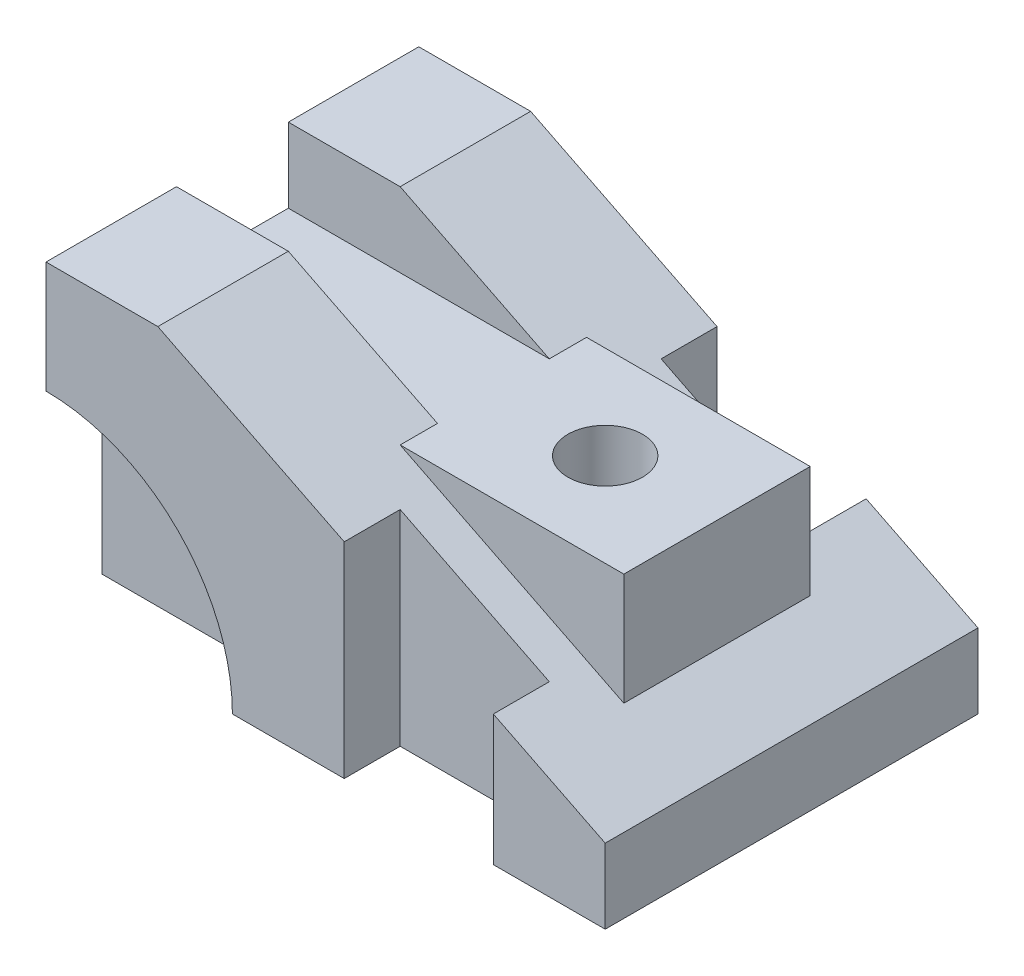
ISO-10303-21;
HEADER;
FILE_DESCRIPTION(('STEP AP214'),'2;1');
FILE_NAME('part.step','',(''),(''),'','','');
FILE_SCHEMA(('AUTOMOTIVE_DESIGN { 1 0 10303 214 1 1 1 1 }'));
ENDSEC;
DATA;
#1=APPLICATION_CONTEXT('core data for automotive mechanical design processes');
#2=APPLICATION_PROTOCOL_DEFINITION('international standard','automotive_design',2000,#1);
#3=PRODUCT_CONTEXT('',#1,'mechanical');
#4=PRODUCT('Part','Part','',(#3));
#5=PRODUCT_RELATED_PRODUCT_CATEGORY('part','',(#4));
#6=PRODUCT_DEFINITION_FORMATION('','',#4);
#7=PRODUCT_DEFINITION_CONTEXT('part definition',#1,'design');
#8=PRODUCT_DEFINITION('design','',#6,#7);
#9=PRODUCT_DEFINITION_SHAPE('','',#8);
#10=(LENGTH_UNIT() NAMED_UNIT(*) SI_UNIT(.MILLI.,.METRE.));
#11=(NAMED_UNIT(*) PLANE_ANGLE_UNIT() SI_UNIT($,.RADIAN.));
#12=(NAMED_UNIT(*) SI_UNIT($,.STERADIAN.) SOLID_ANGLE_UNIT());
#13=UNCERTAINTY_MEASURE_WITH_UNIT(LENGTH_MEASURE(1.E-05),#10,'distance_accuracy_value','');
#14=(GEOMETRIC_REPRESENTATION_CONTEXT(3) GLOBAL_UNCERTAINTY_ASSIGNED_CONTEXT((#13)) GLOBAL_UNIT_ASSIGNED_CONTEXT((#10,
#11,#12)) REPRESENTATION_CONTEXT('',''));
#15=CARTESIAN_POINT('',(0.,0.,0.));
#16=DIRECTION('',(0.,0.,1.));
#17=DIRECTION('',(1.,0.,0.));
#18=AXIS2_PLACEMENT_3D('',#15,#16,#17);
#19=CARTESIAN_POINT('',(-22.0618556701031,38.6082474226804,-100.));
#20=DIRECTION('',(0.,1.,0.));
#21=DIRECTION('',(-1.,0.,0.));
#22=AXIS2_PLACEMENT_3D('',#19,#20,#21);
#23=PLANE('',#22);
#24=DIRECTION('',(-1.,0.,0.));
#25=VECTOR('',#24,1.);
#26=CARTESIAN_POINT('',(47.9381443298969,38.6082474226804,-65.));
#27=LINE('',#26,#25);
#28=CARTESIAN_POINT('',(-22.0618556701031,38.6082474226804,-65.));
#29=VERTEX_POINT('',#28);
#30=CARTESIAN_POINT('',(-52.0618556701031,38.6082474226804,-65.));
#31=VERTEX_POINT('',#30);
#32=EDGE_CURVE('E238',#29,#31,#27,.T.);
#33=ORIENTED_EDGE('',*,*,#32,.F.);
#34=DIRECTION('',(0.,0.,1.));
#35=VECTOR('',#34,1.);
#36=CARTESIAN_POINT('',(-22.0618556701031,38.6082474226804,-100.));
#37=LINE('',#36,#35);
#38=CARTESIAN_POINT('',(-22.0618556701031,38.6082474226804,-100.));
#39=VERTEX_POINT('',#38);
#40=EDGE_CURVE('E411',#39,#29,#37,.T.);
#41=ORIENTED_EDGE('',*,*,#40,.F.);
#42=DIRECTION('',(-1.,0.,0.));
#43=VECTOR('',#42,1.);
#44=CARTESIAN_POINT('',(-22.0618556701031,38.6082474226804,-100.));
#45=LINE('',#44,#43);
#46=CARTESIAN_POINT('',(-52.0618556701031,38.6082474226804,-100.));
#47=VERTEX_POINT('',#46);
#48=EDGE_CURVE('E368',#39,#47,#45,.T.);
#49=ORIENTED_EDGE('',*,*,#48,.T.);
#50=DIRECTION('',(0.,0.,1.));
#51=VECTOR('',#50,1.);
#52=CARTESIAN_POINT('',(-52.0618556701031,38.6082474226804,-100.));
#53=LINE('',#52,#51);
#54=EDGE_CURVE('E427',#47,#31,#53,.T.);
#55=ORIENTED_EDGE('',*,*,#54,.T.);
#56=EDGE_LOOP('',(#33,#41,#49,#55));
#57=FACE_BOUND('',#56,.T.);
#58=ADVANCED_FACE('F45',(#57),#23,.T.);
#59=CARTESIAN_POINT('',(0.,0.,-100.));
#60=DIRECTION('',(0.,0.,1.));
#61=DIRECTION('',(1.,0.,0.));
#62=AXIS2_PLACEMENT_3D('',#59,#60,#61);
#63=PLANE('',#62);
#64=DIRECTION('',(-0.894427190999916,0.447213595499958,0.));
#65=VECTOR('',#64,1.);
#66=CARTESIAN_POINT('',(97.9381443298969,-21.3917525773196,-100.));
#67=LINE('',#66,#65);
#68=CARTESIAN_POINT('',(27.9381443298969,13.6082474226804,-100.));
#69=VERTEX_POINT('',#68);
#70=EDGE_CURVE('E386',#69,#39,#67,.T.);
#71=ORIENTED_EDGE('',*,*,#70,.F.);
#72=DIRECTION('',(0.,-1.,0.));
#73=VECTOR('',#72,1.);
#74=CARTESIAN_POINT('',(27.9381443298969,0.,-100.));
#75=LINE('',#74,#73);
#76=CARTESIAN_POINT('',(27.9381443298969,-41.3917525773196,-100.));
#77=VERTEX_POINT('',#76);
#78=EDGE_CURVE('E11',#69,#77,#75,.T.);
#79=ORIENTED_EDGE('',*,*,#78,.T.);
#80=DIRECTION('',(1.,0.,0.));
#81=VECTOR('',#80,1.);
#82=CARTESIAN_POINT('',(-52.0618556701031,-41.3917525773196,-100.));
#83=LINE('',#82,#81);
#84=CARTESIAN_POINT('',(-2.06185567010309,-41.3917525773196,-100.));
#85=VERTEX_POINT('',#84);
#86=EDGE_CURVE('E378',#85,#77,#83,.T.);
#87=ORIENTED_EDGE('',*,*,#86,.F.);
#88=CARTESIAN_POINT('',(-52.0618556701031,-41.3917525773196,-100.));
#89=DIRECTION('',(0.,0.,-1.));
#90=DIRECTION('',(-1.,0.,0.));
#91=AXIS2_PLACEMENT_3D('',#88,#89,#90);
#92=CIRCLE('',#91,50.);
#93=CARTESIAN_POINT('',(-52.0618556701031,8.6082474226804,-100.));
#94=VERTEX_POINT('',#93);
#95=EDGE_CURVE('E333',#94,#85,#92,.T.);
#96=ORIENTED_EDGE('',*,*,#95,.F.);
#97=DIRECTION('',(0.,-1.,0.));
#98=VECTOR('',#97,1.);
#99=CARTESIAN_POINT('',(-52.0618556701031,38.6082474226804,-100.));
#100=LINE('',#99,#98);
#101=EDGE_CURVE('E372',#47,#94,#100,.T.);
#102=ORIENTED_EDGE('',*,*,#101,.F.);
#103=ORIENTED_EDGE('',*,*,#48,.F.);
#104=EDGE_LOOP('',(#71,#79,#87,#96,#102,#103));
#105=FACE_BOUND('',#104,.T.);
#106=ADVANCED_FACE('F513',(#105),#63,.F.);
#107=CARTESIAN_POINT('',(0.,0.,0.));
#108=DIRECTION('',(0.,0.,1.));
#109=DIRECTION('',(1.,0.,0.));
#110=AXIS2_PLACEMENT_3D('',#107,#108,#109);
#111=PLANE('',#110);
#112=DIRECTION('',(0.,1.,0.));
#113=VECTOR('',#112,1.);
#114=CARTESIAN_POINT('',(67.9381443298969,0.,0.));
#115=LINE('',#114,#113);
#116=CARTESIAN_POINT('',(67.9381443298969,-41.3917525773196,0.));
#117=VERTEX_POINT('',#116);
#118=CARTESIAN_POINT('',(67.9381443298969,-6.39175257731959,0.));
#119=VERTEX_POINT('',#118);
#120=EDGE_CURVE('E441',#117,#119,#115,.T.);
#121=ORIENTED_EDGE('',*,*,#120,.F.);
#122=DIRECTION('',(1.,0.,0.));
#123=VECTOR('',#122,1.);
#124=CARTESIAN_POINT('',(-52.0618556701031,-41.3917525773196,0.));
#125=LINE('',#124,#123);
#126=CARTESIAN_POINT('',(97.9381443298969,-41.3917525773196,0.));
#127=VERTEX_POINT('',#126);
#128=EDGE_CURVE('E398',#117,#127,#125,.T.);
#129=ORIENTED_EDGE('',*,*,#128,.T.);
#130=DIRECTION('',(0.,1.,0.));
#131=VECTOR('',#130,1.);
#132=CARTESIAN_POINT('',(97.9381443298969,-41.3917525773196,0.));
#133=LINE('',#132,#131);
#134=CARTESIAN_POINT('',(97.9381443298969,-21.3917525773196,0.));
#135=VERTEX_POINT('',#134);
#136=EDGE_CURVE('E403',#127,#135,#133,.T.);
#137=ORIENTED_EDGE('',*,*,#136,.T.);
#138=DIRECTION('',(-0.894427190999916,0.447213595499958,0.));
#139=VECTOR('',#138,1.);
#140=CARTESIAN_POINT('',(97.9381443298969,-21.3917525773196,0.));
#141=LINE('',#140,#139);
#142=EDGE_CURVE('E373',#135,#119,#141,.T.);
#143=ORIENTED_EDGE('',*,*,#142,.T.);
#144=EDGE_LOOP('',(#121,#129,#137,#143));
#145=FACE_BOUND('',#144,.T.);
#146=ADVANCED_FACE('F473',(#145),#111,.T.);
#147=DIRECTION('',(-1.,0.,0.));
#148=VECTOR('',#147,1.);
#149=CARTESIAN_POINT('',(47.9381443298969,38.6082474226804,-35.));
#150=LINE('',#149,#148);
#151=CARTESIAN_POINT('',(-22.0618556701031,38.6082474226804,-35.));
#152=VERTEX_POINT('',#151);
#153=CARTESIAN_POINT('',(-52.0618556701031,38.6082474226804,-35.));
#154=VERTEX_POINT('',#153);
#155=EDGE_CURVE('E219',#152,#154,#150,.T.);
#156=ORIENTED_EDGE('',*,*,#155,.T.);
#157=CARTESIAN_POINT('',(-52.0618556701031,38.6082474226804,0.));
#158=VERTEX_POINT('',#157);
#159=EDGE_CURVE('E231',#154,#158,#53,.T.);
#160=ORIENTED_EDGE('',*,*,#159,.T.);
#161=DIRECTION('',(-1.,0.,0.));
#162=VECTOR('',#161,1.);
#163=CARTESIAN_POINT('',(-22.0618556701031,38.6082474226804,0.));
#164=LINE('',#163,#162);
#165=CARTESIAN_POINT('',(-22.0618556701031,38.6082474226804,0.));
#166=VERTEX_POINT('',#165);
#167=EDGE_CURVE('E367',#166,#158,#164,.T.);
#168=ORIENTED_EDGE('',*,*,#167,.F.);
#169=EDGE_CURVE('E416',#152,#166,#37,.T.);
#170=ORIENTED_EDGE('',*,*,#169,.F.);
#171=EDGE_LOOP('',(#156,#160,#168,#170));
#172=FACE_BOUND('',#171,.T.);
#173=ADVANCED_FACE('F47',(#172),#23,.T.);
#174=CARTESIAN_POINT('',(97.9381443298969,-21.3917525773196,-100.));
#175=DIRECTION('',(0.447213595499958,0.894427190999916,0.));
#176=DIRECTION('',(-0.894427190999916,0.447213595499958,0.));
#177=AXIS2_PLACEMENT_3D('',#174,#175,#176);
#178=PLANE('',#177);
#179=DIRECTION('',(-0.894427190999916,0.447213595499958,0.));
#180=VECTOR('',#179,1.);
#181=CARTESIAN_POINT('',(97.9381443298969,-21.3917525773196,-65.));
#182=LINE('',#181,#180);
#183=CARTESIAN_POINT('',(17.9381443298969,18.6082474226804,-65.));
#184=VERTEX_POINT('',#183);
#185=EDGE_CURVE('E245',#184,#29,#182,.T.);
#186=ORIENTED_EDGE('',*,*,#185,.F.);
#187=DIRECTION('',(0.,0.,-1.));
#188=VECTOR('',#187,1.);
#189=CARTESIAN_POINT('',(17.9381443298969,18.6082474226804,-25.));
#190=LINE('',#189,#188);
#191=CARTESIAN_POINT('',(17.9381443298969,18.6082474226804,-75.));
#192=VERTEX_POINT('',#191);
#193=EDGE_CURVE('E69',#184,#192,#190,.T.);
#194=ORIENTED_EDGE('',*,*,#193,.T.);
#195=DIRECTION('',(-0.894427190999916,0.447213595499958,0.));
#196=VECTOR('',#195,1.);
#197=CARTESIAN_POINT('',(97.9381443298969,-21.3917525773196,-75.));
#198=LINE('',#197,#196);
#199=CARTESIAN_POINT('',(77.9381443298969,-11.3917525773196,-75.));
#200=VERTEX_POINT('',#199);
#201=EDGE_CURVE('E268',#200,#192,#198,.T.);
#202=ORIENTED_EDGE('',*,*,#201,.F.);
#203=DIRECTION('',(0.,0.,-1.));
#204=VECTOR('',#203,1.);
#205=CARTESIAN_POINT('',(77.9381443298969,-11.3917525773196,-100.));
#206=LINE('',#205,#204);
#207=CARTESIAN_POINT('',(77.9381443298969,-11.3917525773196,-25.));
#208=VERTEX_POINT('',#207);
#209=EDGE_CURVE('E275',#208,#200,#206,.T.);
#210=ORIENTED_EDGE('',*,*,#209,.F.);
#211=DIRECTION('',(0.894427190999916,-0.447213595499958,0.));
#212=VECTOR('',#211,1.);
#213=CARTESIAN_POINT('',(97.9381443298969,-21.3917525773196,-25.));
#214=LINE('',#213,#212);
#215=CARTESIAN_POINT('',(17.9381443298969,18.6082474226804,-25.));
#216=VERTEX_POINT('',#215);
#217=EDGE_CURVE('E278',#216,#208,#214,.T.);
#218=ORIENTED_EDGE('',*,*,#217,.F.);
#219=CARTESIAN_POINT('',(17.9381443298969,18.6082474226804,-35.));
#220=VERTEX_POINT('',#219);
#221=EDGE_CURVE('E248',#216,#220,#190,.T.);
#222=ORIENTED_EDGE('',*,*,#221,.T.);
#223=DIRECTION('',(0.894427190999916,-0.447213595499958,0.));
#224=VECTOR('',#223,1.);
#225=CARTESIAN_POINT('',(97.9381443298969,-21.3917525773196,-35.));
#226=LINE('',#225,#224);
#227=EDGE_CURVE('E215',#152,#220,#226,.T.);
#228=ORIENTED_EDGE('',*,*,#227,.F.);
#229=ORIENTED_EDGE('',*,*,#169,.T.);
#230=CARTESIAN_POINT('',(27.9381443298969,13.6082474226804,0.));
#231=VERTEX_POINT('',#230);
#232=EDGE_CURVE('E407',#231,#166,#141,.T.);
#233=ORIENTED_EDGE('',*,*,#232,.F.);
#234=DIRECTION('',(0.,0.,1.));
#235=VECTOR('',#234,1.);
#236=CARTESIAN_POINT('',(27.9381443298969,13.6082474226804,-100.));
#237=LINE('',#236,#235);
#238=CARTESIAN_POINT('',(27.9381443298969,13.6082474226804,-15.));
#239=VERTEX_POINT('',#238);
#240=EDGE_CURVE('E298',#239,#231,#237,.T.);
#241=ORIENTED_EDGE('',*,*,#240,.F.);
#242=DIRECTION('',(-0.894427190999916,0.447213595499958,0.));
#243=VECTOR('',#242,1.);
#244=CARTESIAN_POINT('',(97.9381443298969,-21.3917525773196,-15.));
#245=LINE('',#244,#243);
#246=CARTESIAN_POINT('',(67.9381443298969,-6.3917525773196,-15.));
#247=VERTEX_POINT('',#246);
#248=EDGE_CURVE('E330',#247,#239,#245,.T.);
#249=ORIENTED_EDGE('',*,*,#248,.F.);
#250=DIRECTION('',(0.,0.,-1.));
#251=VECTOR('',#250,1.);
#252=CARTESIAN_POINT('',(67.9381443298969,-6.39175257731959,-100.));
#253=LINE('',#252,#251);
#254=EDGE_CURVE('E318',#119,#247,#253,.T.);
#255=ORIENTED_EDGE('',*,*,#254,.F.);
#256=ORIENTED_EDGE('',*,*,#142,.F.);
#257=DIRECTION('',(0.,0.,1.));
#258=VECTOR('',#257,1.);
#259=CARTESIAN_POINT('',(97.9381443298969,-21.3917525773196,-100.));
#260=LINE('',#259,#258);
#261=CARTESIAN_POINT('',(97.9381443298969,-21.3917525773196,-100.));
#262=VERTEX_POINT('',#261);
#263=EDGE_CURVE('E417',#262,#135,#260,.T.);
#264=ORIENTED_EDGE('',*,*,#263,.F.);
#265=CARTESIAN_POINT('',(67.9381443298969,-6.39175257731959,-100.));
#266=VERTEX_POINT('',#265);
#267=EDGE_CURVE('E387',#262,#266,#67,.T.);
#268=ORIENTED_EDGE('',*,*,#267,.T.);
#269=DIRECTION('',(0.,0.,-1.));
#270=VECTOR('',#269,1.);
#271=CARTESIAN_POINT('',(67.9381443298969,-6.39175257731959,-100.));
#272=LINE('',#271,#270);
#273=CARTESIAN_POINT('',(67.9381443298969,-6.3917525773196,-85.));
#274=VERTEX_POINT('',#273);
#275=EDGE_CURVE('E321',#274,#266,#272,.T.);
#276=ORIENTED_EDGE('',*,*,#275,.F.);
#277=DIRECTION('',(0.894427190999916,-0.447213595499958,0.));
#278=VECTOR('',#277,1.);
#279=CARTESIAN_POINT('',(97.9381443298969,-21.3917525773196,-85.));
#280=LINE('',#279,#278);
#281=CARTESIAN_POINT('',(27.9381443298969,13.6082474226804,-85.));
#282=VERTEX_POINT('',#281);
#283=EDGE_CURVE('E327',#282,#274,#280,.T.);
#284=ORIENTED_EDGE('',*,*,#283,.F.);
#285=DIRECTION('',(0.,0.,1.));
#286=VECTOR('',#285,1.);
#287=CARTESIAN_POINT('',(27.9381443298969,13.6082474226804,-100.));
#288=LINE('',#287,#286);
#289=EDGE_CURVE('E324',#69,#282,#288,.T.);
#290=ORIENTED_EDGE('',*,*,#289,.F.);
#291=ORIENTED_EDGE('',*,*,#70,.T.);
#292=ORIENTED_EDGE('',*,*,#40,.T.);
#293=EDGE_LOOP('',(#186,#194,#202,#210,#218,#222,#228,#229,#233,#241,#249,#255,#256,#264,#268,
#276,#284,#290,#291,#292));
#294=FACE_BOUND('',#293,.T.);
#295=ADVANCED_FACE('F453',(#294),#178,.T.);
#296=CARTESIAN_POINT('',(97.9381443298969,-41.3917525773196,-100.));
#297=DIRECTION('',(1.,0.,0.));
#298=DIRECTION('',(0.,0.,-1.));
#299=AXIS2_PLACEMENT_3D('',#296,#297,#298);
#300=PLANE('',#299);
#301=ORIENTED_EDGE('',*,*,#136,.F.);
#302=DIRECTION('',(0.,0.,1.));
#303=VECTOR('',#302,1.);
#304=CARTESIAN_POINT('',(97.9381443298969,-41.3917525773196,-100.));
#305=LINE('',#304,#303);
#306=CARTESIAN_POINT('',(97.9381443298969,-41.3917525773196,-100.));
#307=VERTEX_POINT('',#306);
#308=EDGE_CURVE('E420',#307,#127,#305,.T.);
#309=ORIENTED_EDGE('',*,*,#308,.F.);
#310=DIRECTION('',(0.,1.,0.));
#311=VECTOR('',#310,1.);
#312=CARTESIAN_POINT('',(97.9381443298969,-41.3917525773196,-100.));
#313=LINE('',#312,#311);
#314=EDGE_CURVE('E382',#307,#262,#313,.T.);
#315=ORIENTED_EDGE('',*,*,#314,.T.);
#316=ORIENTED_EDGE('',*,*,#263,.T.);
#317=EDGE_LOOP('',(#301,#309,#315,#316));
#318=FACE_BOUND('',#317,.T.);
#319=ADVANCED_FACE('F460',(#318),#300,.T.);
#320=CARTESIAN_POINT('',(-52.0618556701031,-41.3917525773196,-100.));
#321=DIRECTION('',(0.,-1.,0.));
#322=DIRECTION('',(0.,0.,-1.));
#323=AXIS2_PLACEMENT_3D('',#320,#321,#322);
#324=PLANE('',#323);
#325=CARTESIAN_POINT('',(47.9381443298969,-41.3917525773196,-50.));
#326=DIRECTION('',(0.,-1.,0.));
#327=DIRECTION('',(0.,0.,-1.));
#328=AXIS2_PLACEMENT_3D('',#325,#326,#327);
#329=CIRCLE('',#328,10.);
#330=CARTESIAN_POINT('',(47.9381443298969,-41.3917525773196,-60.));
#331=VERTEX_POINT('',#330);
#332=EDGE_CURVE('E760',#331,#331,#329,.T.);
#333=ORIENTED_EDGE('',*,*,#332,.F.);
#334=EDGE_LOOP('',(#333));
#335=FACE_BOUND('',#334,.T.);
#336=DIRECTION('',(0.,0.,1.));
#337=VECTOR('',#336,1.);
#338=CARTESIAN_POINT('',(67.9381443298969,-41.3917525773196,0.));
#339=LINE('',#338,#337);
#340=CARTESIAN_POINT('',(67.9381443298969,-41.3917525773196,-15.));
#341=VERTEX_POINT('',#340);
#342=EDGE_CURVE('E282',#341,#117,#339,.T.);
#343=ORIENTED_EDGE('',*,*,#342,.F.);
#344=DIRECTION('',(1.,0.,0.));
#345=VECTOR('',#344,1.);
#346=CARTESIAN_POINT('',(67.9381443298969,-41.3917525773196,-15.));
#347=LINE('',#346,#345);
#348=CARTESIAN_POINT('',(27.9381443298969,-41.3917525773196,-15.));
#349=VERTEX_POINT('',#348);
#350=EDGE_CURVE('E290',#349,#341,#347,.T.);
#351=ORIENTED_EDGE('',*,*,#350,.F.);
#352=DIRECTION('',(0.,0.,-1.));
#353=VECTOR('',#352,1.);
#354=CARTESIAN_POINT('',(27.9381443298969,-41.3917525773196,0.));
#355=LINE('',#354,#353);
#356=CARTESIAN_POINT('',(27.9381443298969,-41.3917525773196,0.));
#357=VERTEX_POINT('',#356);
#358=EDGE_CURVE('E285',#357,#349,#355,.T.);
#359=ORIENTED_EDGE('',*,*,#358,.F.);
#360=CARTESIAN_POINT('',(-2.06185567010309,-41.3917525773196,0.));
#361=VERTEX_POINT('',#360);
#362=EDGE_CURVE('E399',#361,#357,#125,.T.);
#363=ORIENTED_EDGE('',*,*,#362,.F.);
#364=DIRECTION('',(0.,0.,1.));
#365=VECTOR('',#364,1.);
#366=CARTESIAN_POINT('',(-2.06185567010309,-41.3917525773196,-15.));
#367=LINE('',#366,#365);
#368=CARTESIAN_POINT('',(-2.06185567010309,-41.3917525773196,-15.));
#369=VERTEX_POINT('',#368);
#370=EDGE_CURVE('E360',#369,#361,#367,.T.);
#371=ORIENTED_EDGE('',*,*,#370,.F.);
#372=DIRECTION('',(-1.,0.,0.));
#373=VECTOR('',#372,1.);
#374=CARTESIAN_POINT('',(-52.0618556701031,-41.3917525773196,-15.));
#375=LINE('',#374,#373);
#376=CARTESIAN_POINT('',(-52.0618556701031,-41.3917525773196,-15.));
#377=VERTEX_POINT('',#376);
#378=EDGE_CURVE('E363',#369,#377,#375,.T.);
#379=ORIENTED_EDGE('',*,*,#378,.T.);
#380=DIRECTION('',(0.,0.,1.));
#381=VECTOR('',#380,1.);
#382=CARTESIAN_POINT('',(-52.0618556701031,-41.3917525773196,-100.));
#383=LINE('',#382,#381);
#384=CARTESIAN_POINT('',(-52.0618556701031,-41.3917525773196,-85.));
#385=VERTEX_POINT('',#384);
#386=EDGE_CURVE('E424',#385,#377,#383,.T.);
#387=ORIENTED_EDGE('',*,*,#386,.F.);
#388=DIRECTION('',(1.,0.,0.));
#389=VECTOR('',#388,1.);
#390=CARTESIAN_POINT('',(-52.0618556701031,-41.3917525773196,-85.));
#391=LINE('',#390,#389);
#392=CARTESIAN_POINT('',(-2.06185567010309,-41.3917525773196,-85.));
#393=VERTEX_POINT('',#392);
#394=EDGE_CURVE('E346',#385,#393,#391,.T.);
#395=ORIENTED_EDGE('',*,*,#394,.T.);
#396=DIRECTION('',(0.,0.,-1.));
#397=VECTOR('',#396,1.);
#398=CARTESIAN_POINT('',(-2.06185567010309,-41.3917525773196,-85.));
#399=LINE('',#398,#397);
#400=EDGE_CURVE('E343',#85,#393,#399,.F.);
#401=ORIENTED_EDGE('',*,*,#400,.F.);
#402=ORIENTED_EDGE('',*,*,#86,.T.);
#403=DIRECTION('',(0.,0.,-1.));
#404=VECTOR('',#403,1.);
#405=CARTESIAN_POINT('',(27.9381443298969,-41.3917525773196,-100.));
#406=LINE('',#405,#404);
#407=CARTESIAN_POINT('',(27.9381443298969,-41.3917525773196,-85.));
#408=VERTEX_POINT('',#407);
#409=EDGE_CURVE('E286',#408,#77,#406,.T.);
#410=ORIENTED_EDGE('',*,*,#409,.F.);
#411=DIRECTION('',(-1.,0.,0.));
#412=VECTOR('',#411,1.);
#413=CARTESIAN_POINT('',(27.9381443298969,-41.3917525773196,-85.));
#414=LINE('',#413,#412);
#415=CARTESIAN_POINT('',(67.9381443298969,-41.3917525773196,-85.));
#416=VERTEX_POINT('',#415);
#417=EDGE_CURVE('E304',#416,#408,#414,.T.);
#418=ORIENTED_EDGE('',*,*,#417,.F.);
#419=DIRECTION('',(0.,0.,1.));
#420=VECTOR('',#419,1.);
#421=CARTESIAN_POINT('',(67.9381443298969,-41.3917525773196,-100.));
#422=LINE('',#421,#420);
#423=CARTESIAN_POINT('',(67.9381443298969,-41.3917525773196,-100.));
#424=VERTEX_POINT('',#423);
#425=EDGE_CURVE('E310',#424,#416,#422,.T.);
#426=ORIENTED_EDGE('',*,*,#425,.F.);
#427=EDGE_CURVE('E377',#424,#307,#83,.T.);
#428=ORIENTED_EDGE('',*,*,#427,.T.);
#429=ORIENTED_EDGE('',*,*,#308,.T.);
#430=ORIENTED_EDGE('',*,*,#128,.F.);
#431=EDGE_LOOP('',(#343,#351,#359,#363,#371,#379,#387,#395,#401,#402,#410,#418,#426,#428,#429,#430));
#432=FACE_BOUND('',#431,.T.);
#433=ADVANCED_FACE('F464',(#335,#432),#324,.T.);
#434=CARTESIAN_POINT('',(-52.0618556701031,38.6082474226804,-100.));
#435=DIRECTION('',(-1.,0.,0.));
#436=DIRECTION('',(0.,-1.,0.));
#437=AXIS2_PLACEMENT_3D('',#434,#435,#436);
#438=PLANE('',#437);
#439=DIRECTION('',(0.,-1.,0.));
#440=VECTOR('',#439,1.);
#441=CARTESIAN_POINT('',(-52.0618556701031,38.6082474226804,-65.));
#442=LINE('',#441,#440);
#443=CARTESIAN_POINT('',(-52.0618556701031,18.6082474226804,-65.));
#444=VERTEX_POINT('',#443);
#445=EDGE_CURVE('E61',#31,#444,#442,.T.);
#446=ORIENTED_EDGE('',*,*,#445,.F.);
#447=ORIENTED_EDGE('',*,*,#54,.F.);
#448=ORIENTED_EDGE('',*,*,#101,.T.);
#449=DIRECTION('',(0.,0.,-1.));
#450=VECTOR('',#449,1.);
#451=CARTESIAN_POINT('',(-52.0618556701031,8.6082474226804,-85.));
#452=LINE('',#451,#450);
#453=CARTESIAN_POINT('',(-52.0618556701031,8.6082474226804,-85.));
#454=VERTEX_POINT('',#453);
#455=EDGE_CURVE('E338',#454,#94,#452,.T.);
#456=ORIENTED_EDGE('',*,*,#455,.F.);
#457=DIRECTION('',(0.,-1.,0.));
#458=VECTOR('',#457,1.);
#459=CARTESIAN_POINT('',(-52.0618556701031,38.6082474226804,-85.));
#460=LINE('',#459,#458);
#461=EDGE_CURVE('E434',#454,#385,#460,.T.);
#462=ORIENTED_EDGE('',*,*,#461,.T.);
#463=ORIENTED_EDGE('',*,*,#386,.T.);
#464=DIRECTION('',(0.,1.,0.));
#465=VECTOR('',#464,1.);
#466=CARTESIAN_POINT('',(-52.0618556701031,38.6082474226804,-15.));
#467=LINE('',#466,#465);
#468=CARTESIAN_POINT('',(-52.0618556701031,8.6082474226804,-15.));
#469=VERTEX_POINT('',#468);
#470=EDGE_CURVE('E415',#377,#469,#467,.T.);
#471=ORIENTED_EDGE('',*,*,#470,.T.);
#472=DIRECTION('',(0.,0.,1.));
#473=VECTOR('',#472,1.);
#474=CARTESIAN_POINT('',(-52.0618556701031,8.6082474226804,-15.));
#475=LINE('',#474,#473);
#476=CARTESIAN_POINT('',(-52.0618556701031,8.6082474226804,0.));
#477=VERTEX_POINT('',#476);
#478=EDGE_CURVE('E355',#477,#469,#475,.F.);
#479=ORIENTED_EDGE('',*,*,#478,.F.);
#480=DIRECTION('',(0.,-1.,0.));
#481=VECTOR('',#480,1.);
#482=CARTESIAN_POINT('',(-52.0618556701031,38.6082474226804,0.));
#483=LINE('',#482,#481);
#484=EDGE_CURVE('E394',#158,#477,#483,.T.);
#485=ORIENTED_EDGE('',*,*,#484,.F.);
#486=ORIENTED_EDGE('',*,*,#159,.F.);
#487=DIRECTION('',(0.,1.,0.));
#488=VECTOR('',#487,1.);
#489=CARTESIAN_POINT('',(-52.0618556701031,38.6082474226804,-35.));
#490=LINE('',#489,#488);
#491=CARTESIAN_POINT('',(-52.0618556701031,18.6082474226804,-35.));
#492=VERTEX_POINT('',#491);
#493=EDGE_CURVE('E212',#492,#154,#490,.T.);
#494=ORIENTED_EDGE('',*,*,#493,.F.);
#495=DIRECTION('',(0.,0.,1.));
#496=VECTOR('',#495,1.);
#497=CARTESIAN_POINT('',(-52.0618556701031,18.6082474226804,-65.));
#498=LINE('',#497,#496);
#499=EDGE_CURVE('E223',#444,#492,#498,.T.);
#500=ORIENTED_EDGE('',*,*,#499,.F.);
#501=EDGE_LOOP('',(#446,#447,#448,#456,#462,#463,#471,#479,#485,#486,#494,#500));
#502=FACE_BOUND('',#501,.T.);
#503=ADVANCED_FACE('F229',(#502),#438,.T.);
#504=ORIENTED_EDGE('',*,*,#427,.F.);
#505=DIRECTION('',(0.,1.,0.));
#506=VECTOR('',#505,1.);
#507=CARTESIAN_POINT('',(67.9381443298969,0.,-100.));
#508=LINE('',#507,#506);
#509=EDGE_CURVE('E54',#424,#266,#508,.T.);
#510=ORIENTED_EDGE('',*,*,#509,.T.);
#511=ORIENTED_EDGE('',*,*,#267,.F.);
#512=ORIENTED_EDGE('',*,*,#314,.F.);
#513=EDGE_LOOP('',(#504,#510,#511,#512));
#514=FACE_BOUND('',#513,.T.);
#515=ADVANCED_FACE('F448',(#514),#63,.F.);
#516=DIRECTION('',(0.,-1.,0.));
#517=VECTOR('',#516,1.);
#518=CARTESIAN_POINT('',(27.9381443298969,0.,0.));
#519=LINE('',#518,#517);
#520=EDGE_CURVE('E438',#231,#357,#519,.T.);
#521=ORIENTED_EDGE('',*,*,#520,.F.);
#522=ORIENTED_EDGE('',*,*,#232,.T.);
#523=ORIENTED_EDGE('',*,*,#167,.T.);
#524=ORIENTED_EDGE('',*,*,#484,.T.);
#525=CARTESIAN_POINT('',(-52.0618556701031,-41.3917525773196,0.));
#526=DIRECTION('',(0.,0.,1.));
#527=DIRECTION('',(1.,0.,0.));
#528=AXIS2_PLACEMENT_3D('',#525,#526,#527);
#529=CIRCLE('',#528,50.);
#530=EDGE_CURVE('E350',#361,#477,#529,.T.);
#531=ORIENTED_EDGE('',*,*,#530,.F.);
#532=ORIENTED_EDGE('',*,*,#362,.T.);
#533=EDGE_LOOP('',(#521,#522,#523,#524,#531,#532));
#534=FACE_BOUND('',#533,.T.);
#535=ADVANCED_FACE('F492',(#534),#111,.T.);
#536=CARTESIAN_POINT('',(-52.0618556701031,-41.3917525773196,-15.));
#537=DIRECTION('',(0.,0.,1.));
#538=DIRECTION('',(1.,0.,0.));
#539=AXIS2_PLACEMENT_3D('',#536,#537,#538);
#540=CYLINDRICAL_SURFACE('',#539,50.);
#541=ORIENTED_EDGE('',*,*,#370,.T.);
#542=ORIENTED_EDGE('',*,*,#530,.T.);
#543=ORIENTED_EDGE('',*,*,#478,.T.);
#544=CARTESIAN_POINT('',(-52.0618556701031,-41.3917525773196,-15.));
#545=DIRECTION('',(0.,0.,1.));
#546=DIRECTION('',(1.,0.,0.));
#547=AXIS2_PLACEMENT_3D('',#544,#545,#546);
#548=CIRCLE('',#547,50.);
#549=EDGE_CURVE('E351',#369,#469,#548,.T.);
#550=ORIENTED_EDGE('',*,*,#549,.F.);
#551=EDGE_LOOP('',(#541,#542,#543,#550));
#552=FACE_BOUND('',#551,.T.);
#553=ADVANCED_FACE('F495',(#552),#540,.F.);
#554=CARTESIAN_POINT('',(-52.0618556701031,-41.3917525773196,-15.));
#555=DIRECTION('',(0.,0.,1.));
#556=DIRECTION('',(1.,0.,0.));
#557=AXIS2_PLACEMENT_3D('',#554,#555,#556);
#558=PLANE('',#557);
#559=ORIENTED_EDGE('',*,*,#549,.T.);
#560=ORIENTED_EDGE('',*,*,#470,.F.);
#561=ORIENTED_EDGE('',*,*,#378,.F.);
#562=EDGE_LOOP('',(#559,#560,#561));
#563=FACE_BOUND('',#562,.T.);
#564=ADVANCED_FACE('F500',(#563),#558,.T.);
#565=CARTESIAN_POINT('',(-52.0618556701031,-41.3917525773196,-85.));
#566=DIRECTION('',(0.,0.,-1.));
#567=DIRECTION('',(-1.,0.,0.));
#568=AXIS2_PLACEMENT_3D('',#565,#566,#567);
#569=CYLINDRICAL_SURFACE('',#568,50.);
#570=ORIENTED_EDGE('',*,*,#400,.T.);
#571=CARTESIAN_POINT('',(-52.0618556701031,-41.3917525773196,-85.));
#572=DIRECTION('',(0.,0.,-1.));
#573=DIRECTION('',(-1.,0.,0.));
#574=AXIS2_PLACEMENT_3D('',#571,#572,#573);
#575=CIRCLE('',#574,50.);
#576=EDGE_CURVE('E334',#454,#393,#575,.T.);
#577=ORIENTED_EDGE('',*,*,#576,.F.);
#578=ORIENTED_EDGE('',*,*,#455,.T.);
#579=ORIENTED_EDGE('',*,*,#95,.T.);
#580=EDGE_LOOP('',(#570,#577,#578,#579));
#581=FACE_BOUND('',#580,.T.);
#582=ADVANCED_FACE('F510',(#581),#569,.F.);
#583=CARTESIAN_POINT('',(-52.0618556701031,-41.3917525773196,-85.));
#584=DIRECTION('',(0.,0.,-1.));
#585=DIRECTION('',(-1.,0.,0.));
#586=AXIS2_PLACEMENT_3D('',#583,#584,#585);
#587=PLANE('',#586);
#588=ORIENTED_EDGE('',*,*,#461,.F.);
#589=ORIENTED_EDGE('',*,*,#576,.T.);
#590=ORIENTED_EDGE('',*,*,#394,.F.);
#591=EDGE_LOOP('',(#588,#589,#590));
#592=FACE_BOUND('',#591,.T.);
#593=ADVANCED_FACE('F504',(#592),#587,.T.);
#594=CARTESIAN_POINT('',(67.9381443298969,33.6082474226804,0.));
#595=DIRECTION('',(1.,0.,0.));
#596=DIRECTION('',(0.,0.,-1.));
#597=AXIS2_PLACEMENT_3D('',#594,#595,#596);
#598=PLANE('',#597);
#599=ORIENTED_EDGE('',*,*,#254,.T.);
#600=DIRECTION('',(0.,-1.,0.));
#601=VECTOR('',#600,1.);
#602=CARTESIAN_POINT('',(67.9381443298969,33.6082474226804,-15.));
#603=LINE('',#602,#601);
#604=EDGE_CURVE('E295',#247,#341,#603,.T.);
#605=ORIENTED_EDGE('',*,*,#604,.T.);
#606=ORIENTED_EDGE('',*,*,#342,.T.);
#607=ORIENTED_EDGE('',*,*,#120,.T.);
#608=EDGE_LOOP('',(#599,#605,#606,#607));
#609=FACE_BOUND('',#608,.T.);
#610=ADVANCED_FACE('F475',(#609),#598,.F.);
#611=CARTESIAN_POINT('',(67.9381443298969,33.6082474226804,-15.));
#612=DIRECTION('',(0.,0.,-1.));
#613=DIRECTION('',(-1.,0.,0.));
#614=AXIS2_PLACEMENT_3D('',#611,#612,#613);
#615=PLANE('',#614);
#616=ORIENTED_EDGE('',*,*,#248,.T.);
#617=DIRECTION('',(0.,-1.,0.));
#618=VECTOR('',#617,1.);
#619=CARTESIAN_POINT('',(27.9381443298969,33.6082474226804,-15.));
#620=LINE('',#619,#618);
#621=EDGE_CURVE('E294',#239,#349,#620,.T.);
#622=ORIENTED_EDGE('',*,*,#621,.T.);
#623=ORIENTED_EDGE('',*,*,#350,.T.);
#624=ORIENTED_EDGE('',*,*,#604,.F.);
#625=EDGE_LOOP('',(#616,#622,#623,#624));
#626=FACE_BOUND('',#625,.T.);
#627=ADVANCED_FACE('F482',(#626),#615,.F.);
#628=CARTESIAN_POINT('',(27.9381443298969,33.6082474226804,0.));
#629=DIRECTION('',(-1.,0.,0.));
#630=DIRECTION('',(0.,0.,1.));
#631=AXIS2_PLACEMENT_3D('',#628,#629,#630);
#632=PLANE('',#631);
#633=ORIENTED_EDGE('',*,*,#240,.T.);
#634=ORIENTED_EDGE('',*,*,#520,.T.);
#635=ORIENTED_EDGE('',*,*,#358,.T.);
#636=ORIENTED_EDGE('',*,*,#621,.F.);
#637=EDGE_LOOP('',(#633,#634,#635,#636));
#638=FACE_BOUND('',#637,.T.);
#639=ADVANCED_FACE('F484',(#638),#632,.F.);
#640=CARTESIAN_POINT('',(27.9381443298969,33.6082474226804,-100.));
#641=DIRECTION('',(-1.,0.,0.));
#642=DIRECTION('',(0.,0.,1.));
#643=AXIS2_PLACEMENT_3D('',#640,#641,#642);
#644=PLANE('',#643);
#645=ORIENTED_EDGE('',*,*,#289,.T.);
#646=DIRECTION('',(0.,-1.,0.));
#647=VECTOR('',#646,1.);
#648=CARTESIAN_POINT('',(27.9381443298969,33.6082474226804,-85.));
#649=LINE('',#648,#647);
#650=EDGE_CURVE('E281',#282,#408,#649,.T.);
#651=ORIENTED_EDGE('',*,*,#650,.T.);
#652=ORIENTED_EDGE('',*,*,#409,.T.);
#653=ORIENTED_EDGE('',*,*,#78,.F.);
#654=EDGE_LOOP('',(#645,#651,#652,#653));
#655=FACE_BOUND('',#654,.T.);
#656=ADVANCED_FACE('F517',(#655),#644,.F.);
#657=CARTESIAN_POINT('',(27.9381443298969,33.6082474226804,-85.));
#658=DIRECTION('',(0.,0.,1.));
#659=DIRECTION('',(1.,0.,0.));
#660=AXIS2_PLACEMENT_3D('',#657,#658,#659);
#661=PLANE('',#660);
#662=ORIENTED_EDGE('',*,*,#283,.T.);
#663=DIRECTION('',(0.,-1.,0.));
#664=VECTOR('',#663,1.);
#665=CARTESIAN_POINT('',(67.9381443298969,33.6082474226804,-85.));
#666=LINE('',#665,#664);
#667=EDGE_CURVE('E301',#274,#416,#666,.T.);
#668=ORIENTED_EDGE('',*,*,#667,.T.);
#669=ORIENTED_EDGE('',*,*,#417,.T.);
#670=ORIENTED_EDGE('',*,*,#650,.F.);
#671=EDGE_LOOP('',(#662,#668,#669,#670));
#672=FACE_BOUND('',#671,.T.);
#673=ADVANCED_FACE('F521',(#672),#661,.F.);
#674=CARTESIAN_POINT('',(67.9381443298969,33.6082474226804,-100.));
#675=DIRECTION('',(1.,0.,0.));
#676=DIRECTION('',(0.,0.,-1.));
#677=AXIS2_PLACEMENT_3D('',#674,#675,#676);
#678=PLANE('',#677);
#679=ORIENTED_EDGE('',*,*,#275,.T.);
#680=ORIENTED_EDGE('',*,*,#509,.F.);
#681=ORIENTED_EDGE('',*,*,#425,.T.);
#682=ORIENTED_EDGE('',*,*,#667,.F.);
#683=EDGE_LOOP('',(#679,#680,#681,#682));
#684=FACE_BOUND('',#683,.T.);
#685=ADVANCED_FACE('F523',(#684),#678,.F.);
#686=CARTESIAN_POINT('',(17.9381443298969,18.6082474226804,-25.));
#687=DIRECTION('',(0.,0.,1.));
#688=DIRECTION('',(1.,0.,0.));
#689=AXIS2_PLACEMENT_3D('',#686,#687,#688);
#690=PLANE('',#689);
#691=DIRECTION('',(-1.,0.,0.));
#692=VECTOR('',#691,1.);
#693=CARTESIAN_POINT('',(17.9381443298969,18.6082474226804,-25.));
#694=LINE('',#693,#692);
#695=CARTESIAN_POINT('',(77.9381443298969,18.6082474226804,-25.));
#696=VERTEX_POINT('',#695);
#697=EDGE_CURVE('E259',#696,#216,#694,.T.);
#698=ORIENTED_EDGE('',*,*,#697,.T.);
#699=ORIENTED_EDGE('',*,*,#217,.T.);
#700=DIRECTION('',(0.,-1.,0.));
#701=VECTOR('',#700,1.);
#702=CARTESIAN_POINT('',(77.9381443298969,18.6082474226804,-25.));
#703=LINE('',#702,#701);
#704=EDGE_CURVE('E264',#696,#208,#703,.T.);
#705=ORIENTED_EDGE('',*,*,#704,.F.);
#706=EDGE_LOOP('',(#698,#699,#705));
#707=FACE_BOUND('',#706,.T.);
#708=ADVANCED_FACE('F525',(#707),#690,.T.);
#709=CARTESIAN_POINT('',(77.9381443298969,18.6082474226804,-25.));
#710=DIRECTION('',(1.,0.,0.));
#711=DIRECTION('',(0.,0.,-1.));
#712=AXIS2_PLACEMENT_3D('',#709,#710,#711);
#713=PLANE('',#712);
#714=ORIENTED_EDGE('',*,*,#704,.T.);
#715=ORIENTED_EDGE('',*,*,#209,.T.);
#716=DIRECTION('',(0.,-1.,0.));
#717=VECTOR('',#716,1.);
#718=CARTESIAN_POINT('',(77.9381443298969,18.6082474226804,-75.));
#719=LINE('',#718,#717);
#720=CARTESIAN_POINT('',(77.9381443298969,18.6082474226804,-75.));
#721=VERTEX_POINT('',#720);
#722=EDGE_CURVE('E263',#721,#200,#719,.T.);
#723=ORIENTED_EDGE('',*,*,#722,.F.);
#724=DIRECTION('',(0.,0.,1.));
#725=VECTOR('',#724,1.);
#726=CARTESIAN_POINT('',(77.9381443298969,18.6082474226804,-25.));
#727=LINE('',#726,#725);
#728=EDGE_CURVE('E255',#721,#696,#727,.T.);
#729=ORIENTED_EDGE('',*,*,#728,.T.);
#730=EDGE_LOOP('',(#714,#715,#723,#729));
#731=FACE_BOUND('',#730,.T.);
#732=ADVANCED_FACE('F531',(#731),#713,.T.);
#733=CARTESIAN_POINT('',(17.9381443298969,18.6082474226804,-75.));
#734=DIRECTION('',(0.,0.,-1.));
#735=DIRECTION('',(-1.,0.,0.));
#736=AXIS2_PLACEMENT_3D('',#733,#734,#735);
#737=PLANE('',#736);
#738=ORIENTED_EDGE('',*,*,#722,.T.);
#739=ORIENTED_EDGE('',*,*,#201,.T.);
#740=DIRECTION('',(1.,0.,0.));
#741=VECTOR('',#740,1.);
#742=CARTESIAN_POINT('',(17.9381443298969,18.6082474226804,-75.));
#743=LINE('',#742,#741);
#744=EDGE_CURVE('E251',#192,#721,#743,.T.);
#745=ORIENTED_EDGE('',*,*,#744,.T.);
#746=EDGE_LOOP('',(#738,#739,#745));
#747=FACE_BOUND('',#746,.T.);
#748=ADVANCED_FACE('F560',(#747),#737,.T.);
#749=CARTESIAN_POINT('',(0.,18.6082474226804,0.));
#750=DIRECTION('',(0.,-1.,0.));
#751=DIRECTION('',(0.,0.,-1.));
#752=AXIS2_PLACEMENT_3D('',#749,#750,#751);
#753=PLANE('',#752);
#754=CARTESIAN_POINT('',(47.9381443298969,18.6082474226804,-50.));
#755=DIRECTION('',(0.,1.,0.));
#756=DIRECTION('',(0.,0.,1.));
#757=AXIS2_PLACEMENT_3D('',#754,#755,#756);
#758=CIRCLE('',#757,10.);
#759=CARTESIAN_POINT('',(47.9381443298969,18.6082474226804,-40.));
#760=VERTEX_POINT('',#759);
#761=EDGE_CURVE('E762',#760,#760,#758,.T.);
#762=ORIENTED_EDGE('',*,*,#761,.F.);
#763=EDGE_LOOP('',(#762));
#764=FACE_BOUND('',#763,.T.);
#765=ORIENTED_EDGE('',*,*,#193,.F.);
#766=DIRECTION('',(-1.,0.,0.));
#767=VECTOR('',#766,1.);
#768=CARTESIAN_POINT('',(47.9381443298969,18.6082474226804,-65.));
#769=LINE('',#768,#767);
#770=EDGE_CURVE('E220',#184,#444,#769,.T.);
#771=ORIENTED_EDGE('',*,*,#770,.T.);
#772=ORIENTED_EDGE('',*,*,#499,.T.);
#773=DIRECTION('',(-1.,0.,0.));
#774=VECTOR('',#773,1.);
#775=CARTESIAN_POINT('',(47.9381443298969,18.6082474226804,-35.));
#776=LINE('',#775,#774);
#777=EDGE_CURVE('E208',#220,#492,#776,.T.);
#778=ORIENTED_EDGE('',*,*,#777,.F.);
#779=ORIENTED_EDGE('',*,*,#221,.F.);
#780=ORIENTED_EDGE('',*,*,#697,.F.);
#781=ORIENTED_EDGE('',*,*,#728,.F.);
#782=ORIENTED_EDGE('',*,*,#744,.F.);
#783=EDGE_LOOP('',(#765,#771,#772,#778,#779,#780,#781,#782));
#784=FACE_BOUND('',#783,.T.);
#785=ADVANCED_FACE('F224',(#764,#784),#753,.F.);
#786=CARTESIAN_POINT('',(47.9381443298969,38.6082474226804,-65.));
#787=DIRECTION('',(0.,0.,-1.));
#788=DIRECTION('',(-1.,0.,0.));
#789=AXIS2_PLACEMENT_3D('',#786,#787,#788);
#790=PLANE('',#789);
#791=ORIENTED_EDGE('',*,*,#185,.T.);
#792=ORIENTED_EDGE('',*,*,#32,.T.);
#793=ORIENTED_EDGE('',*,*,#445,.T.);
#794=ORIENTED_EDGE('',*,*,#770,.F.);
#795=EDGE_LOOP('',(#791,#792,#793,#794));
#796=FACE_BOUND('',#795,.T.);
#797=ADVANCED_FACE('F566',(#796),#790,.F.);
#798=CARTESIAN_POINT('',(47.9381443298969,38.6082474226804,-35.));
#799=DIRECTION('',(0.,0.,1.));
#800=DIRECTION('',(1.,0.,0.));
#801=AXIS2_PLACEMENT_3D('',#798,#799,#800);
#802=PLANE('',#801);
#803=ORIENTED_EDGE('',*,*,#227,.T.);
#804=ORIENTED_EDGE('',*,*,#777,.T.);
#805=ORIENTED_EDGE('',*,*,#493,.T.);
#806=ORIENTED_EDGE('',*,*,#155,.F.);
#807=EDGE_LOOP('',(#803,#804,#805,#806));
#808=FACE_BOUND('',#807,.T.);
#809=ADVANCED_FACE('F210',(#808),#802,.F.);
#810=CARTESIAN_POINT('',(47.9381443298969,-81.3917525773196,-50.));
#811=DIRECTION('',(0.,1.,0.));
#812=DIRECTION('',(0.,0.,1.));
#813=AXIS2_PLACEMENT_3D('',#810,#811,#812);
#814=CYLINDRICAL_SURFACE('',#813,10.);
#815=ORIENTED_EDGE('',*,*,#332,.T.);
#816=EDGE_LOOP('',(#815));
#817=FACE_BOUND('',#816,.T.);
#818=ORIENTED_EDGE('',*,*,#761,.T.);
#819=EDGE_LOOP('',(#818));
#820=FACE_BOUND('',#819,.T.);
#821=ADVANCED_FACE('F634',(#817,#820),#814,.F.);
#822=CLOSED_SHELL('',(#58,#106,#146,#173,#295,#319,#433,#503,#515,#535,#553,#564,#582,#593,#610,
#627,#639,#656,#673,#685,#708,#732,#748,#785,#797,#809,#821));
#823=MANIFOLD_SOLID_BREP('B2',#822);
#824=ADVANCED_BREP_SHAPE_REPRESENTATION('',(#18,#823),#14);
#825=SHAPE_DEFINITION_REPRESENTATION(#9,#824);
ENDSEC;
END-ISO-10303-21;
